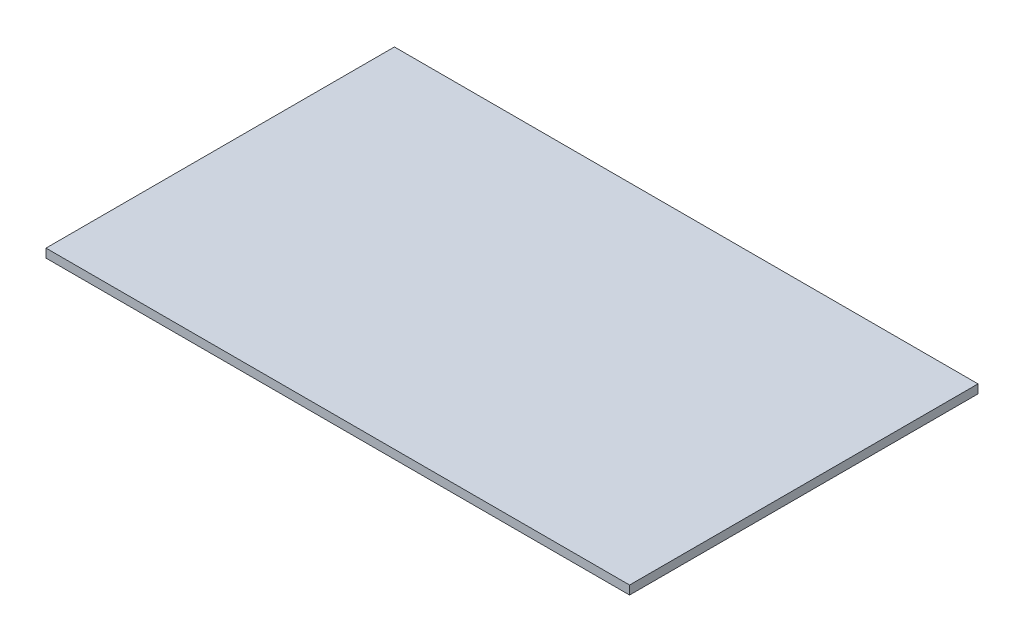
ISO-10303-21;
HEADER;
FILE_DESCRIPTION(('STEP AP214'),'2;1');
FILE_NAME('part.step','',(''),(''),'','','');
FILE_SCHEMA(('AUTOMOTIVE_DESIGN { 1 0 10303 214 1 1 1 1 }'));
ENDSEC;
DATA;
#1=APPLICATION_CONTEXT('core data for automotive mechanical design processes');
#2=APPLICATION_PROTOCOL_DEFINITION('international standard','automotive_design',2000,#1);
#3=PRODUCT_CONTEXT('',#1,'mechanical');
#4=PRODUCT('Part','Part','',(#3));
#5=PRODUCT_RELATED_PRODUCT_CATEGORY('part','',(#4));
#6=PRODUCT_DEFINITION_FORMATION('','',#4);
#7=PRODUCT_DEFINITION_CONTEXT('part definition',#1,'design');
#8=PRODUCT_DEFINITION('design','',#6,#7);
#9=PRODUCT_DEFINITION_SHAPE('','',#8);
#10=(LENGTH_UNIT() NAMED_UNIT(*) SI_UNIT(.MILLI.,.METRE.));
#11=(NAMED_UNIT(*) PLANE_ANGLE_UNIT() SI_UNIT($,.RADIAN.));
#12=(NAMED_UNIT(*) SI_UNIT($,.STERADIAN.) SOLID_ANGLE_UNIT());
#13=UNCERTAINTY_MEASURE_WITH_UNIT(LENGTH_MEASURE(1.E-05),#10,'distance_accuracy_value','');
#14=(GEOMETRIC_REPRESENTATION_CONTEXT(3) GLOBAL_UNCERTAINTY_ASSIGNED_CONTEXT((#13)) GLOBAL_UNIT_ASSIGNED_CONTEXT((#10,
#11,#12)) REPRESENTATION_CONTEXT('',''));
#15=CARTESIAN_POINT('',(0.,0.,0.));
#16=DIRECTION('',(0.,0.,1.));
#17=DIRECTION('',(1.,0.,0.));
#18=AXIS2_PLACEMENT_3D('',#15,#16,#17);
#19=CARTESIAN_POINT('',(0.,10.,0.));
#20=DIRECTION('',(1.,0.,0.));
#21=DIRECTION('',(0.,0.,-1.));
#22=AXIS2_PLACEMENT_3D('',#19,#20,#21);
#23=PLANE('',#22);
#24=DIRECTION('',(0.,0.,1.));
#25=VECTOR('',#24,1.);
#26=CARTESIAN_POINT('',(0.,0.,0.));
#27=LINE('',#26,#25);
#28=CARTESIAN_POINT('',(0.,0.,-400.));
#29=VERTEX_POINT('',#28);
#30=CARTESIAN_POINT('',(0.,0.,0.));
#31=VERTEX_POINT('',#30);
#32=EDGE_CURVE('E94',#29,#31,#27,.T.);
#33=ORIENTED_EDGE('',*,*,#32,.T.);
#34=DIRECTION('',(0.,-1.,0.));
#35=VECTOR('',#34,1.);
#36=CARTESIAN_POINT('',(0.,10.,0.));
#37=LINE('',#36,#35);
#38=CARTESIAN_POINT('',(0.,10.,0.));
#39=VERTEX_POINT('',#38);
#40=EDGE_CURVE('E11',#39,#31,#37,.T.);
#41=ORIENTED_EDGE('',*,*,#40,.F.);
#42=DIRECTION('',(0.,0.,1.));
#43=VECTOR('',#42,1.);
#44=CARTESIAN_POINT('',(0.,10.,0.));
#45=LINE('',#44,#43);
#46=CARTESIAN_POINT('',(0.,10.,-400.));
#47=VERTEX_POINT('',#46);
#48=EDGE_CURVE('E82',#47,#39,#45,.T.);
#49=ORIENTED_EDGE('',*,*,#48,.F.);
#50=DIRECTION('',(0.,-1.,0.));
#51=VECTOR('',#50,1.);
#52=CARTESIAN_POINT('',(0.,10.,-400.));
#53=LINE('',#52,#51);
#54=EDGE_CURVE('E90',#47,#29,#53,.T.);
#55=ORIENTED_EDGE('',*,*,#54,.T.);
#56=EDGE_LOOP('',(#33,#41,#49,#55));
#57=FACE_BOUND('',#56,.T.);
#58=ADVANCED_FACE('F31',(#57),#23,.F.);
#59=CARTESIAN_POINT('',(0.,10.,0.));
#60=DIRECTION('',(0.,0.,-1.));
#61=DIRECTION('',(-1.,0.,0.));
#62=AXIS2_PLACEMENT_3D('',#59,#60,#61);
#63=PLANE('',#62);
#64=DIRECTION('',(1.,0.,0.));
#65=VECTOR('',#64,1.);
#66=CARTESIAN_POINT('',(0.,0.,0.));
#67=LINE('',#66,#65);
#68=CARTESIAN_POINT('',(670.,0.,0.));
#69=VERTEX_POINT('',#68);
#70=EDGE_CURVE('E86',#31,#69,#67,.T.);
#71=ORIENTED_EDGE('',*,*,#70,.T.);
#72=DIRECTION('',(0.,-1.,0.));
#73=VECTOR('',#72,1.);
#74=CARTESIAN_POINT('',(670.,10.,0.));
#75=LINE('',#74,#73);
#76=CARTESIAN_POINT('',(670.,10.,0.));
#77=VERTEX_POINT('',#76);
#78=EDGE_CURVE('E39',#77,#69,#75,.T.);
#79=ORIENTED_EDGE('',*,*,#78,.F.);
#80=DIRECTION('',(1.,0.,0.));
#81=VECTOR('',#80,1.);
#82=CARTESIAN_POINT('',(0.,10.,0.));
#83=LINE('',#82,#81);
#84=EDGE_CURVE('E77',#39,#77,#83,.T.);
#85=ORIENTED_EDGE('',*,*,#84,.F.);
#86=ORIENTED_EDGE('',*,*,#40,.T.);
#87=EDGE_LOOP('',(#71,#79,#85,#86));
#88=FACE_BOUND('',#87,.T.);
#89=ADVANCED_FACE('F85',(#88),#63,.F.);
#90=CARTESIAN_POINT('',(670.,10.,0.));
#91=DIRECTION('',(-1.,0.,0.));
#92=DIRECTION('',(0.,0.,1.));
#93=AXIS2_PLACEMENT_3D('',#90,#91,#92);
#94=PLANE('',#93);
#95=DIRECTION('',(0.,0.,-1.));
#96=VECTOR('',#95,1.);
#97=CARTESIAN_POINT('',(670.,0.,0.));
#98=LINE('',#97,#96);
#99=CARTESIAN_POINT('',(670.,0.,-400.));
#100=VERTEX_POINT('',#99);
#101=EDGE_CURVE('E64',#69,#100,#98,.T.);
#102=ORIENTED_EDGE('',*,*,#101,.T.);
#103=DIRECTION('',(0.,-1.,0.));
#104=VECTOR('',#103,1.);
#105=CARTESIAN_POINT('',(670.,10.,-400.));
#106=LINE('',#105,#104);
#107=CARTESIAN_POINT('',(670.,10.,-400.));
#108=VERTEX_POINT('',#107);
#109=EDGE_CURVE('E87',#108,#100,#106,.T.);
#110=ORIENTED_EDGE('',*,*,#109,.F.);
#111=DIRECTION('',(0.,0.,-1.));
#112=VECTOR('',#111,1.);
#113=CARTESIAN_POINT('',(670.,10.,0.));
#114=LINE('',#113,#112);
#115=EDGE_CURVE('E80',#77,#108,#114,.T.);
#116=ORIENTED_EDGE('',*,*,#115,.F.);
#117=ORIENTED_EDGE('',*,*,#78,.T.);
#118=EDGE_LOOP('',(#102,#110,#116,#117));
#119=FACE_BOUND('',#118,.T.);
#120=ADVANCED_FACE('F88',(#119),#94,.F.);
#121=CARTESIAN_POINT('',(0.,10.,-400.));
#122=DIRECTION('',(0.,0.,1.));
#123=DIRECTION('',(1.,0.,0.));
#124=AXIS2_PLACEMENT_3D('',#121,#122,#123);
#125=PLANE('',#124);
#126=DIRECTION('',(-1.,0.,0.));
#127=VECTOR('',#126,1.);
#128=CARTESIAN_POINT('',(0.,0.,-400.));
#129=LINE('',#128,#127);
#130=EDGE_CURVE('E70',#100,#29,#129,.T.);
#131=ORIENTED_EDGE('',*,*,#130,.T.);
#132=ORIENTED_EDGE('',*,*,#54,.F.);
#133=DIRECTION('',(-1.,0.,0.));
#134=VECTOR('',#133,1.);
#135=CARTESIAN_POINT('',(0.,10.,-400.));
#136=LINE('',#135,#134);
#137=EDGE_CURVE('E47',#108,#47,#136,.T.);
#138=ORIENTED_EDGE('',*,*,#137,.F.);
#139=ORIENTED_EDGE('',*,*,#109,.T.);
#140=EDGE_LOOP('',(#131,#132,#138,#139));
#141=FACE_BOUND('',#140,.T.);
#142=ADVANCED_FACE('F101',(#141),#125,.F.);
#143=CARTESIAN_POINT('',(0.,10.,-400.));
#144=DIRECTION('',(0.,-1.,0.));
#145=DIRECTION('',(0.,0.,-1.));
#146=AXIS2_PLACEMENT_3D('',#143,#144,#145);
#147=PLANE('',#146);
#148=ORIENTED_EDGE('',*,*,#48,.T.);
#149=ORIENTED_EDGE('',*,*,#84,.T.);
#150=ORIENTED_EDGE('',*,*,#115,.T.);
#151=ORIENTED_EDGE('',*,*,#137,.T.);
#152=EDGE_LOOP('',(#148,#149,#150,#151));
#153=FACE_BOUND('',#152,.T.);
#154=ADVANCED_FACE('F78',(#153),#147,.F.);
#155=CARTESIAN_POINT('',(0.,0.,-400.));
#156=DIRECTION('',(0.,-1.,0.));
#157=DIRECTION('',(0.,0.,-1.));
#158=AXIS2_PLACEMENT_3D('',#155,#156,#157);
#159=PLANE('',#158);
#160=ORIENTED_EDGE('',*,*,#32,.F.);
#161=ORIENTED_EDGE('',*,*,#130,.F.);
#162=ORIENTED_EDGE('',*,*,#101,.F.);
#163=ORIENTED_EDGE('',*,*,#70,.F.);
#164=EDGE_LOOP('',(#160,#161,#162,#163));
#165=FACE_BOUND('',#164,.T.);
#166=ADVANCED_FACE('F104',(#165),#159,.T.);
#167=CLOSED_SHELL('',(#58,#89,#120,#142,#154,#166));
#168=MANIFOLD_SOLID_BREP('B2',#167);
#169=ADVANCED_BREP_SHAPE_REPRESENTATION('',(#18,#168),#14);
#170=SHAPE_DEFINITION_REPRESENTATION(#9,#169);
ENDSEC;
END-ISO-10303-21;
